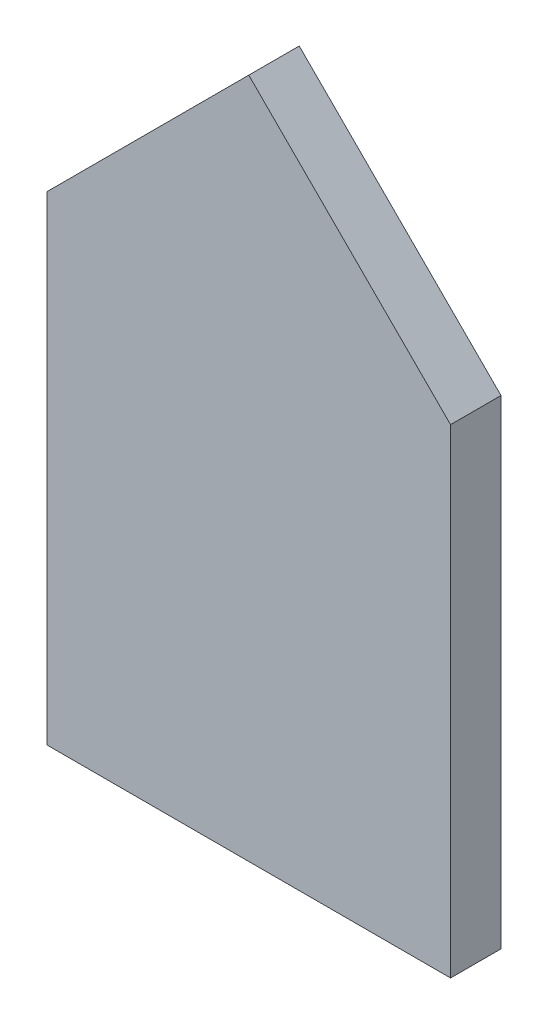
ISO-10303-21;
HEADER;
FILE_DESCRIPTION(('STEP AP214'),'2;1');
FILE_NAME('part.step','',(''),(''),'','','');
FILE_SCHEMA(('AUTOMOTIVE_DESIGN { 1 0 10303 214 1 1 1 1 }'));
ENDSEC;
DATA;
#1=APPLICATION_CONTEXT('core data for automotive mechanical design processes');
#2=APPLICATION_PROTOCOL_DEFINITION('international standard','automotive_design',2000,#1);
#3=PRODUCT_CONTEXT('',#1,'mechanical');
#4=PRODUCT('Part','Part','',(#3));
#5=PRODUCT_RELATED_PRODUCT_CATEGORY('part','',(#4));
#6=PRODUCT_DEFINITION_FORMATION('','',#4);
#7=PRODUCT_DEFINITION_CONTEXT('part definition',#1,'design');
#8=PRODUCT_DEFINITION('design','',#6,#7);
#9=PRODUCT_DEFINITION_SHAPE('','',#8);
#10=(LENGTH_UNIT() NAMED_UNIT(*) SI_UNIT(.MILLI.,.METRE.));
#11=(NAMED_UNIT(*) PLANE_ANGLE_UNIT() SI_UNIT($,.RADIAN.));
#12=(NAMED_UNIT(*) SI_UNIT($,.STERADIAN.) SOLID_ANGLE_UNIT());
#13=UNCERTAINTY_MEASURE_WITH_UNIT(LENGTH_MEASURE(1.E-05),#10,'distance_accuracy_value','');
#14=(GEOMETRIC_REPRESENTATION_CONTEXT(3) GLOBAL_UNCERTAINTY_ASSIGNED_CONTEXT((#13)) GLOBAL_UNIT_ASSIGNED_CONTEXT((#10,
#11,#12)) REPRESENTATION_CONTEXT('',''));
#15=CARTESIAN_POINT('',(0.,0.,0.));
#16=DIRECTION('',(0.,0.,1.));
#17=DIRECTION('',(1.,0.,0.));
#18=AXIS2_PLACEMENT_3D('',#15,#16,#17);
#19=CARTESIAN_POINT('',(0.,57.5140482013543,0.));
#20=DIRECTION('',(0.,0.,1.));
#21=DIRECTION('',(1.,0.,0.));
#22=AXIS2_PLACEMENT_3D('',#19,#20,#21);
#23=PLANE('',#22);
#24=DIRECTION('',(0.,-1.,0.));
#25=VECTOR('',#24,1.);
#26=CARTESIAN_POINT('',(-40.,95.,0.));
#27=LINE('',#26,#25);
#28=CARTESIAN_POINT('',(-40.,95.,0.));
#29=VERTEX_POINT('',#28);
#30=CARTESIAN_POINT('',(-40.,0.,0.));
#31=VERTEX_POINT('',#30);
#32=EDGE_CURVE('E91',#29,#31,#27,.T.);
#33=ORIENTED_EDGE('',*,*,#32,.F.);
#34=DIRECTION('',(-0.707106781186547,-0.707106781186548,0.));
#35=VECTOR('',#34,1.);
#36=CARTESIAN_POINT('',(0.,135.,0.));
#37=LINE('',#36,#35);
#38=CARTESIAN_POINT('',(0.,135.,0.));
#39=VERTEX_POINT('',#38);
#40=EDGE_CURVE('E86',#39,#29,#37,.T.);
#41=ORIENTED_EDGE('',*,*,#40,.F.);
#42=DIRECTION('',(-0.707106781186547,0.707106781186548,0.));
#43=VECTOR('',#42,1.);
#44=CARTESIAN_POINT('',(40.,95.,0.));
#45=LINE('',#44,#43);
#46=CARTESIAN_POINT('',(40.,95.,0.));
#47=VERTEX_POINT('',#46);
#48=EDGE_CURVE('E62',#47,#39,#45,.T.);
#49=ORIENTED_EDGE('',*,*,#48,.F.);
#50=DIRECTION('',(0.,1.,0.));
#51=VECTOR('',#50,1.);
#52=CARTESIAN_POINT('',(40.,0.,0.));
#53=LINE('',#52,#51);
#54=CARTESIAN_POINT('',(40.,0.,0.));
#55=VERTEX_POINT('',#54);
#56=EDGE_CURVE('E64',#55,#47,#53,.T.);
#57=ORIENTED_EDGE('',*,*,#56,.F.);
#58=DIRECTION('',(1.,0.,0.));
#59=VECTOR('',#58,1.);
#60=CARTESIAN_POINT('',(-40.,0.,0.));
#61=LINE('',#60,#59);
#62=EDGE_CURVE('E20',#31,#55,#61,.T.);
#63=ORIENTED_EDGE('',*,*,#62,.F.);
#64=EDGE_LOOP('',(#33,#41,#49,#57,#63));
#65=FACE_BOUND('',#64,.T.);
#66=ADVANCED_FACE('F17',(#65),#23,.F.);
#67=CARTESIAN_POINT('',(-40.,0.,0.));
#68=DIRECTION('',(0.,-1.,0.));
#69=DIRECTION('',(1.,0.,0.));
#70=AXIS2_PLACEMENT_3D('',#67,#68,#69);
#71=PLANE('',#70);
#72=DIRECTION('',(1.,0.,0.));
#73=VECTOR('',#72,1.);
#74=CARTESIAN_POINT('',(0.,0.,10.));
#75=LINE('',#74,#73);
#76=CARTESIAN_POINT('',(-40.,0.,10.));
#77=VERTEX_POINT('',#76);
#78=CARTESIAN_POINT('',(40.,0.,10.));
#79=VERTEX_POINT('',#78);
#80=EDGE_CURVE('E95',#77,#79,#75,.T.);
#81=ORIENTED_EDGE('',*,*,#80,.F.);
#82=DIRECTION('',(0.,0.,1.));
#83=VECTOR('',#82,1.);
#84=CARTESIAN_POINT('',(-40.,0.,0.));
#85=LINE('',#84,#83);
#86=EDGE_CURVE('E75',#31,#77,#85,.T.);
#87=ORIENTED_EDGE('',*,*,#86,.F.);
#88=ORIENTED_EDGE('',*,*,#62,.T.);
#89=DIRECTION('',(0.,0.,1.));
#90=VECTOR('',#89,1.);
#91=CARTESIAN_POINT('',(40.,0.,0.));
#92=LINE('',#91,#90);
#93=EDGE_CURVE('E70',#79,#55,#92,.F.);
#94=ORIENTED_EDGE('',*,*,#93,.F.);
#95=EDGE_LOOP('',(#81,#87,#88,#94));
#96=FACE_BOUND('',#95,.T.);
#97=ADVANCED_FACE('F72',(#96),#71,.T.);
#98=CARTESIAN_POINT('',(40.,0.,0.));
#99=DIRECTION('',(1.,0.,0.));
#100=DIRECTION('',(0.,1.,0.));
#101=AXIS2_PLACEMENT_3D('',#98,#99,#100);
#102=PLANE('',#101);
#103=DIRECTION('',(0.,1.,0.));
#104=VECTOR('',#103,1.);
#105=CARTESIAN_POINT('',(40.,57.5140482013543,10.));
#106=LINE('',#105,#104);
#107=CARTESIAN_POINT('',(40.,95.,10.));
#108=VERTEX_POINT('',#107);
#109=EDGE_CURVE('E79',#79,#108,#106,.T.);
#110=ORIENTED_EDGE('',*,*,#109,.F.);
#111=ORIENTED_EDGE('',*,*,#93,.T.);
#112=ORIENTED_EDGE('',*,*,#56,.T.);
#113=DIRECTION('',(0.,0.,1.));
#114=VECTOR('',#113,1.);
#115=CARTESIAN_POINT('',(40.,95.,0.));
#116=LINE('',#115,#114);
#117=EDGE_CURVE('E82',#108,#47,#116,.F.);
#118=ORIENTED_EDGE('',*,*,#117,.F.);
#119=EDGE_LOOP('',(#110,#111,#112,#118));
#120=FACE_BOUND('',#119,.T.);
#121=ADVANCED_FACE('F77',(#120),#102,.T.);
#122=CARTESIAN_POINT('',(40.,95.,0.));
#123=DIRECTION('',(0.707106781186548,0.707106781186547,0.));
#124=DIRECTION('',(-0.707106781186547,0.707106781186548,0.));
#125=AXIS2_PLACEMENT_3D('',#122,#123,#124);
#126=PLANE('',#125);
#127=DIRECTION('',(-0.707106781186547,0.707106781186548,0.));
#128=VECTOR('',#127,1.);
#129=CARTESIAN_POINT('',(40.,95.,10.));
#130=LINE('',#129,#128);
#131=CARTESIAN_POINT('',(0.,135.,10.));
#132=VERTEX_POINT('',#131);
#133=EDGE_CURVE('E98',#108,#132,#130,.T.);
#134=ORIENTED_EDGE('',*,*,#133,.F.);
#135=ORIENTED_EDGE('',*,*,#117,.T.);
#136=ORIENTED_EDGE('',*,*,#48,.T.);
#137=DIRECTION('',(0.,0.,1.));
#138=VECTOR('',#137,1.);
#139=CARTESIAN_POINT('',(0.,135.,0.));
#140=LINE('',#139,#138);
#141=EDGE_CURVE('E88',#132,#39,#140,.F.);
#142=ORIENTED_EDGE('',*,*,#141,.F.);
#143=EDGE_LOOP('',(#134,#135,#136,#142));
#144=FACE_BOUND('',#143,.T.);
#145=ADVANCED_FACE('F107',(#144),#126,.T.);
#146=CARTESIAN_POINT('',(0.,135.,0.));
#147=DIRECTION('',(-0.707106781186548,0.707106781186547,0.));
#148=DIRECTION('',(-0.707106781186547,-0.707106781186548,0.));
#149=AXIS2_PLACEMENT_3D('',#146,#147,#148);
#150=PLANE('',#149);
#151=DIRECTION('',(-0.707106781186547,-0.707106781186548,0.));
#152=VECTOR('',#151,1.);
#153=CARTESIAN_POINT('',(0.,135.,10.));
#154=LINE('',#153,#152);
#155=CARTESIAN_POINT('',(-40.,95.,10.));
#156=VERTEX_POINT('',#155);
#157=EDGE_CURVE('E26',#132,#156,#154,.T.);
#158=ORIENTED_EDGE('',*,*,#157,.F.);
#159=ORIENTED_EDGE('',*,*,#141,.T.);
#160=ORIENTED_EDGE('',*,*,#40,.T.);
#161=DIRECTION('',(0.,0.,1.));
#162=VECTOR('',#161,1.);
#163=CARTESIAN_POINT('',(-40.,95.,0.));
#164=LINE('',#163,#162);
#165=EDGE_CURVE('E35',#156,#29,#164,.F.);
#166=ORIENTED_EDGE('',*,*,#165,.F.);
#167=EDGE_LOOP('',(#158,#159,#160,#166));
#168=FACE_BOUND('',#167,.T.);
#169=ADVANCED_FACE('F105',(#168),#150,.T.);
#170=CARTESIAN_POINT('',(-40.,95.,0.));
#171=DIRECTION('',(-1.,0.,0.));
#172=DIRECTION('',(0.,-1.,0.));
#173=AXIS2_PLACEMENT_3D('',#170,#171,#172);
#174=PLANE('',#173);
#175=DIRECTION('',(0.,1.,0.));
#176=VECTOR('',#175,1.);
#177=CARTESIAN_POINT('',(-40.,57.5140482013543,10.));
#178=LINE('',#177,#176);
#179=EDGE_CURVE('E11',#156,#77,#178,.F.);
#180=ORIENTED_EDGE('',*,*,#179,.F.);
#181=ORIENTED_EDGE('',*,*,#165,.T.);
#182=ORIENTED_EDGE('',*,*,#32,.T.);
#183=ORIENTED_EDGE('',*,*,#86,.T.);
#184=EDGE_LOOP('',(#180,#181,#182,#183));
#185=FACE_BOUND('',#184,.T.);
#186=ADVANCED_FACE('F109',(#185),#174,.T.);
#187=CARTESIAN_POINT('',(0.,57.5140482013543,10.));
#188=DIRECTION('',(0.,0.,1.));
#189=DIRECTION('',(1.,0.,0.));
#190=AXIS2_PLACEMENT_3D('',#187,#188,#189);
#191=PLANE('',#190);
#192=ORIENTED_EDGE('',*,*,#157,.T.);
#193=ORIENTED_EDGE('',*,*,#179,.T.);
#194=ORIENTED_EDGE('',*,*,#80,.T.);
#195=ORIENTED_EDGE('',*,*,#109,.T.);
#196=ORIENTED_EDGE('',*,*,#133,.T.);
#197=EDGE_LOOP('',(#192,#193,#194,#195,#196));
#198=FACE_BOUND('',#197,.T.);
#199=ADVANCED_FACE('F103',(#198),#191,.T.);
#200=CLOSED_SHELL('',(#66,#97,#121,#145,#169,#186,#199));
#201=MANIFOLD_SOLID_BREP('B1',#200);
#202=ADVANCED_BREP_SHAPE_REPRESENTATION('',(#18,#201),#14);
#203=SHAPE_DEFINITION_REPRESENTATION(#9,#202);
ENDSEC;
END-ISO-10303-21;
